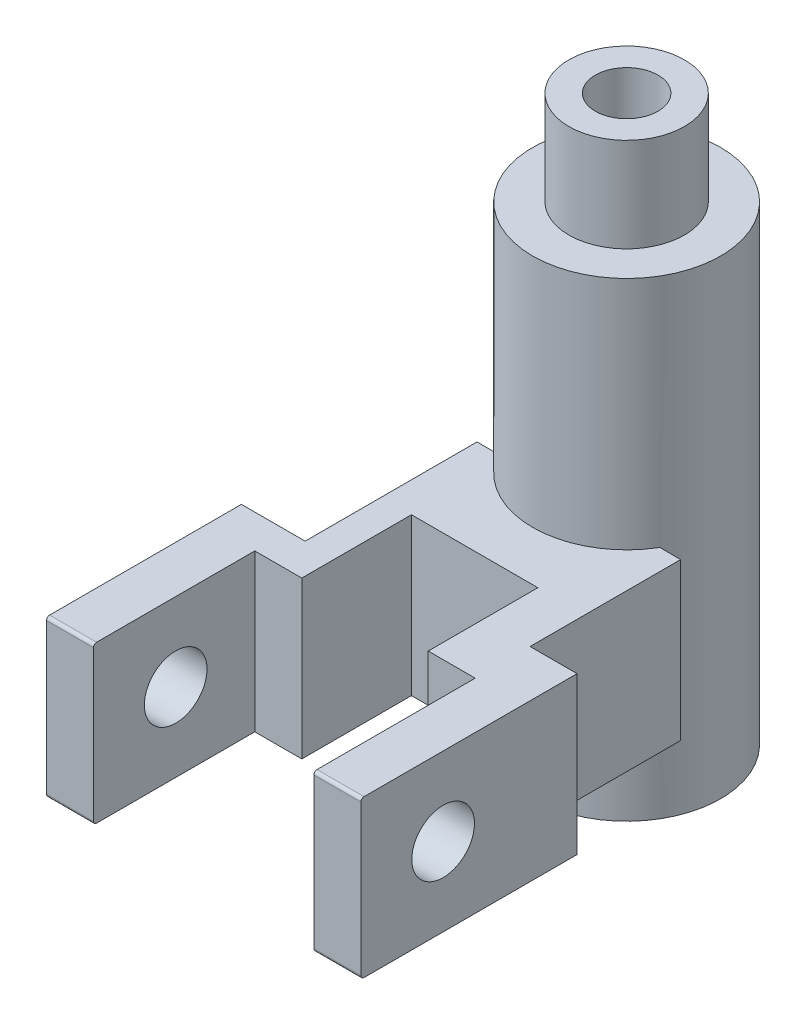
ISO-10303-21;
HEADER;
FILE_DESCRIPTION(('STEP AP214'),'2;1');
FILE_NAME('part.step','',(''),(''),'','','');
FILE_SCHEMA(('AUTOMOTIVE_DESIGN { 1 0 10303 214 1 1 1 1 }'));
ENDSEC;
DATA;
#1=APPLICATION_CONTEXT('core data for automotive mechanical design processes');
#2=APPLICATION_PROTOCOL_DEFINITION('international standard','automotive_design',2000,#1);
#3=PRODUCT_CONTEXT('',#1,'mechanical');
#4=PRODUCT('Part','Part','',(#3));
#5=PRODUCT_RELATED_PRODUCT_CATEGORY('part','',(#4));
#6=PRODUCT_DEFINITION_FORMATION('','',#4);
#7=PRODUCT_DEFINITION_CONTEXT('part definition',#1,'design');
#8=PRODUCT_DEFINITION('design','',#6,#7);
#9=PRODUCT_DEFINITION_SHAPE('','',#8);
#10=(LENGTH_UNIT() NAMED_UNIT(*) SI_UNIT(.MILLI.,.METRE.));
#11=(NAMED_UNIT(*) PLANE_ANGLE_UNIT() SI_UNIT($,.RADIAN.));
#12=(NAMED_UNIT(*) SI_UNIT($,.STERADIAN.) SOLID_ANGLE_UNIT());
#13=UNCERTAINTY_MEASURE_WITH_UNIT(LENGTH_MEASURE(1.E-05),#10,'distance_accuracy_value','');
#14=(GEOMETRIC_REPRESENTATION_CONTEXT(3) GLOBAL_UNCERTAINTY_ASSIGNED_CONTEXT((#13)) GLOBAL_UNIT_ASSIGNED_CONTEXT((#10,
#11,#12)) REPRESENTATION_CONTEXT('',''));
#15=CARTESIAN_POINT('',(0.,0.,0.));
#16=DIRECTION('',(0.,0.,1.));
#17=DIRECTION('',(1.,0.,0.));
#18=AXIS2_PLACEMENT_3D('',#15,#16,#17);
#19=CARTESIAN_POINT('',(22.5141242937853,50.,-46.5536723163842));
#20=DIRECTION('',(0.,0.,1.));
#21=DIRECTION('',(1.,0.,0.));
#22=AXIS2_PLACEMENT_3D('',#19,#20,#21);
#23=PLANE('',#22);
#24=DIRECTION('',(0.,-1.,0.));
#25=VECTOR('',#24,1.);
#26=CARTESIAN_POINT('',(-35.8167045061723,125.,-46.5536723163842));
#27=LINE('',#26,#25);
#28=CARTESIAN_POINT('',(-35.8167045061723,0.,-46.5536723163842));
#29=VERTEX_POINT('',#28);
#30=CARTESIAN_POINT('',(-35.8167045061723,50.,-46.5536723163842));
#31=VERTEX_POINT('',#30);
#32=EDGE_CURVE('E194',#29,#31,#27,.F.);
#33=ORIENTED_EDGE('',*,*,#32,.F.);
#34=DIRECTION('',(-1.,0.,0.));
#35=VECTOR('',#34,1.);
#36=CARTESIAN_POINT('',(22.5141242937853,0.,-46.5536723163842));
#37=LINE('',#36,#35);
#38=CARTESIAN_POINT('',(-42.4858757062147,0.,-46.5536723163842));
#39=VERTEX_POINT('',#38);
#40=EDGE_CURVE('E209',#29,#39,#37,.T.);
#41=ORIENTED_EDGE('',*,*,#40,.T.);
#42=DIRECTION('',(0.,-1.,0.));
#43=VECTOR('',#42,1.);
#44=CARTESIAN_POINT('',(-42.4858757062147,50.,-46.5536723163842));
#45=LINE('',#44,#43);
#46=CARTESIAN_POINT('',(-42.4858757062147,50.,-46.5536723163842));
#47=VERTEX_POINT('',#46);
#48=EDGE_CURVE('E231',#47,#39,#45,.T.);
#49=ORIENTED_EDGE('',*,*,#48,.F.);
#50=DIRECTION('',(-1.,0.,0.));
#51=VECTOR('',#50,1.);
#52=CARTESIAN_POINT('',(22.5141242937853,50.,-46.5536723163842));
#53=LINE('',#52,#51);
#54=EDGE_CURVE('E211',#31,#47,#53,.T.);
#55=ORIENTED_EDGE('',*,*,#54,.F.);
#56=EDGE_LOOP('',(#33,#41,#49,#55));
#57=FACE_BOUND('',#56,.T.);
#58=ADVANCED_FACE('F39',(#57),#23,.F.);
#59=DIRECTION('',(0.,-1.,0.));
#60=VECTOR('',#59,1.);
#61=CARTESIAN_POINT('',(15.8449530937429,125.,-46.5536723163842));
#62=LINE('',#61,#60);
#63=CARTESIAN_POINT('',(15.8449530937429,50.,-46.5536723163842));
#64=VERTEX_POINT('',#63);
#65=CARTESIAN_POINT('',(15.8449530937429,0.,-46.5536723163842));
#66=VERTEX_POINT('',#65);
#67=EDGE_CURVE('E197',#64,#66,#62,.T.);
#68=ORIENTED_EDGE('',*,*,#67,.F.);
#69=CARTESIAN_POINT('',(22.5141242937853,50.,-46.5536723163842));
#70=VERTEX_POINT('',#69);
#71=EDGE_CURVE('E235',#70,#64,#53,.T.);
#72=ORIENTED_EDGE('',*,*,#71,.F.);
#73=DIRECTION('',(0.,-1.,0.));
#74=VECTOR('',#73,1.);
#75=CARTESIAN_POINT('',(22.5141242937853,50.,-46.5536723163842));
#76=LINE('',#75,#74);
#77=CARTESIAN_POINT('',(22.5141242937853,0.,-46.5536723163842));
#78=VERTEX_POINT('',#77);
#79=EDGE_CURVE('E234',#70,#78,#76,.T.);
#80=ORIENTED_EDGE('',*,*,#79,.T.);
#81=EDGE_CURVE('E221',#78,#66,#37,.T.);
#82=ORIENTED_EDGE('',*,*,#81,.T.);
#83=EDGE_LOOP('',(#68,#72,#80,#82));
#84=FACE_BOUND('',#83,.T.);
#85=ADVANCED_FACE('F438',(#84),#23,.F.);
#86=CARTESIAN_POINT('',(-42.4858757062147,50.,-40.6779661016949));
#87=DIRECTION('',(1.,0.,0.));
#88=DIRECTION('',(0.,0.,-1.));
#89=AXIS2_PLACEMENT_3D('',#86,#87,#88);
#90=PLANE('',#89);
#91=DIRECTION('',(0.,0.,1.));
#92=VECTOR('',#91,1.);
#93=CARTESIAN_POINT('',(-42.4858757062147,0.,-40.6779661016949));
#94=LINE('',#93,#92);
#95=CARTESIAN_POINT('',(-42.4858757062147,0.,8.27683615819211));
#96=VERTEX_POINT('',#95);
#97=EDGE_CURVE('E218',#39,#96,#94,.T.);
#98=ORIENTED_EDGE('',*,*,#97,.T.);
#99=DIRECTION('',(0.,-1.,0.));
#100=VECTOR('',#99,1.);
#101=CARTESIAN_POINT('',(-42.4858757062147,50.,8.27683615819211));
#102=LINE('',#101,#100);
#103=CARTESIAN_POINT('',(-42.4858757062147,50.,8.27683615819211));
#104=VERTEX_POINT('',#103);
#105=EDGE_CURVE('E204',#104,#96,#102,.T.);
#106=ORIENTED_EDGE('',*,*,#105,.F.);
#107=DIRECTION('',(0.,0.,1.));
#108=VECTOR('',#107,1.);
#109=CARTESIAN_POINT('',(-42.4858757062147,50.,-46.5536723163842));
#110=LINE('',#109,#108);
#111=EDGE_CURVE('E226',#47,#104,#110,.T.);
#112=ORIENTED_EDGE('',*,*,#111,.F.);
#113=ORIENTED_EDGE('',*,*,#48,.T.);
#114=EDGE_LOOP('',(#98,#106,#112,#113));
#115=FACE_BOUND('',#114,.T.);
#116=ADVANCED_FACE('F467',(#115),#90,.F.);
#117=CARTESIAN_POINT('',(-42.4858757062147,50.,8.27683615819211));
#118=DIRECTION('',(0.,0.,1.));
#119=DIRECTION('',(1.,0.,0.));
#120=AXIS2_PLACEMENT_3D('',#117,#118,#119);
#121=PLANE('',#120);
#122=DIRECTION('',(-1.,0.,0.));
#123=VECTOR('',#122,1.);
#124=CARTESIAN_POINT('',(-42.4858757062147,0.,8.27683615819211));
#125=LINE('',#124,#123);
#126=CARTESIAN_POINT('',(-62.8248587570622,0.,8.27683615819211));
#127=VERTEX_POINT('',#126);
#128=EDGE_CURVE('E392',#96,#127,#125,.T.);
#129=ORIENTED_EDGE('',*,*,#128,.T.);
#130=DIRECTION('',(0.,-1.,0.));
#131=VECTOR('',#130,1.);
#132=CARTESIAN_POINT('',(-62.8248587570622,50.,8.27683615819211));
#133=LINE('',#132,#131);
#134=CARTESIAN_POINT('',(-62.8248587570622,50.,8.27683615819211));
#135=VERTEX_POINT('',#134);
#136=EDGE_CURVE('E287',#135,#127,#133,.T.);
#137=ORIENTED_EDGE('',*,*,#136,.F.);
#138=DIRECTION('',(-1.,0.,0.));
#139=VECTOR('',#138,1.);
#140=CARTESIAN_POINT('',(-42.4858757062147,50.,8.27683615819211));
#141=LINE('',#140,#139);
#142=EDGE_CURVE('E360',#104,#135,#141,.T.);
#143=ORIENTED_EDGE('',*,*,#142,.F.);
#144=ORIENTED_EDGE('',*,*,#105,.T.);
#145=EDGE_LOOP('',(#129,#137,#143,#144));
#146=FACE_BOUND('',#145,.T.);
#147=ADVANCED_FACE('F513',(#146),#121,.F.);
#148=CARTESIAN_POINT('',(-62.8248587570622,50.,39.0112994350283));
#149=DIRECTION('',(1.,0.,0.));
#150=DIRECTION('',(0.,0.,-1.));
#151=AXIS2_PLACEMENT_3D('',#148,#149,#150);
#152=PLANE('',#151);
#153=CARTESIAN_POINT('',(-62.8248587570622,25.,44.2477906118115));
#154=DIRECTION('',(1.,0.,0.));
#155=DIRECTION('',(0.,0.,-1.));
#156=AXIS2_PLACEMENT_3D('',#153,#154,#155);
#157=CIRCLE('',#156,10.);
#158=CARTESIAN_POINT('',(-62.8248587570622,25.,34.2477906118115));
#159=VERTEX_POINT('',#158);
#160=EDGE_CURVE('E585',#159,#159,#157,.T.);
#161=ORIENTED_EDGE('',*,*,#160,.T.);
#162=EDGE_LOOP('',(#161));
#163=FACE_BOUND('',#162,.T.);
#164=DIRECTION('',(0.,0.,1.));
#165=VECTOR('',#164,1.);
#166=CARTESIAN_POINT('',(-62.8248587570622,0.,39.0112994350283));
#167=LINE('',#166,#165);
#168=CARTESIAN_POINT('',(-62.8248587570622,0.,69.4842817885947));
#169=VERTEX_POINT('',#168);
#170=EDGE_CURVE('E396',#127,#169,#167,.T.);
#171=ORIENTED_EDGE('',*,*,#170,.T.);
#172=CARTESIAN_POINT('',(-62.8248587570622,1.,69.4842817885947));
#173=DIRECTION('',(1.,0.,0.));
#174=DIRECTION('',(0.,0.,-1.));
#175=AXIS2_PLACEMENT_3D('',#172,#173,#174);
#176=CIRCLE('',#175,1.);
#177=CARTESIAN_POINT('',(-62.8248587570622,1.,70.4842817885947));
#178=VERTEX_POINT('',#177);
#179=EDGE_CURVE('E316',#169,#178,#176,.F.);
#180=ORIENTED_EDGE('',*,*,#179,.T.);
#181=DIRECTION('',(0.,-1.,0.));
#182=VECTOR('',#181,1.);
#183=CARTESIAN_POINT('',(-62.8248587570622,50.,70.4842817885947));
#184=LINE('',#183,#182);
#185=CARTESIAN_POINT('',(-62.8248587570622,49.,70.4842817885947));
#186=VERTEX_POINT('',#185);
#187=EDGE_CURVE('E283',#186,#178,#184,.T.);
#188=ORIENTED_EDGE('',*,*,#187,.F.);
#189=CARTESIAN_POINT('',(-62.8248587570622,49.,69.4842817885947));
#190=DIRECTION('',(1.,0.,0.));
#191=DIRECTION('',(0.,0.,-1.));
#192=AXIS2_PLACEMENT_3D('',#189,#190,#191);
#193=CIRCLE('',#192,1.);
#194=CARTESIAN_POINT('',(-62.8248587570622,50.,69.4842817885947));
#195=VERTEX_POINT('',#194);
#196=EDGE_CURVE('E313',#186,#195,#193,.F.);
#197=ORIENTED_EDGE('',*,*,#196,.T.);
#198=DIRECTION('',(0.,0.,1.));
#199=VECTOR('',#198,1.);
#200=CARTESIAN_POINT('',(-62.8248587570622,50.,8.27683615819211));
#201=LINE('',#200,#199);
#202=EDGE_CURVE('E346',#135,#195,#201,.T.);
#203=ORIENTED_EDGE('',*,*,#202,.F.);
#204=ORIENTED_EDGE('',*,*,#136,.T.);
#205=EDGE_LOOP('',(#171,#180,#188,#197,#203,#204));
#206=FACE_BOUND('',#205,.T.);
#207=ADVANCED_FACE('F509',(#163,#206),#152,.F.);
#208=CARTESIAN_POINT('',(-62.8248587570622,50.,70.4842817885947));
#209=DIRECTION('',(0.,0.,-1.));
#210=DIRECTION('',(-1.,0.,0.));
#211=AXIS2_PLACEMENT_3D('',#208,#209,#210);
#212=PLANE('',#211);
#213=ORIENTED_EDGE('',*,*,#187,.T.);
#214=DIRECTION('',(1.,0.,0.));
#215=VECTOR('',#214,1.);
#216=CARTESIAN_POINT('',(-47.8248587570622,1.,70.4842817885947));
#217=LINE('',#216,#215);
#218=CARTESIAN_POINT('',(-47.8248587570622,1.,70.4842817885947));
#219=VERTEX_POINT('',#218);
#220=EDGE_CURVE('E297',#178,#219,#217,.T.);
#221=ORIENTED_EDGE('',*,*,#220,.T.);
#222=DIRECTION('',(0.,-1.,0.));
#223=VECTOR('',#222,1.);
#224=CARTESIAN_POINT('',(-47.8248587570622,50.,70.4842817885947));
#225=LINE('',#224,#223);
#226=CARTESIAN_POINT('',(-47.8248587570622,49.,70.4842817885947));
#227=VERTEX_POINT('',#226);
#228=EDGE_CURVE('E279',#227,#219,#225,.T.);
#229=ORIENTED_EDGE('',*,*,#228,.F.);
#230=DIRECTION('',(1.,0.,0.));
#231=VECTOR('',#230,1.);
#232=CARTESIAN_POINT('',(-62.8248587570622,49.,70.4842817885947));
#233=LINE('',#232,#231);
#234=EDGE_CURVE('E294',#227,#186,#233,.F.);
#235=ORIENTED_EDGE('',*,*,#234,.T.);
#236=EDGE_LOOP('',(#213,#221,#229,#235));
#237=FACE_BOUND('',#236,.T.);
#238=ADVANCED_FACE('F505',(#237),#212,.F.);
#239=CARTESIAN_POINT('',(-47.8248587570622,50.,70.4842817885947));
#240=DIRECTION('',(-1.,0.,0.));
#241=DIRECTION('',(0.,0.,1.));
#242=AXIS2_PLACEMENT_3D('',#239,#240,#241);
#243=PLANE('',#242);
#244=CARTESIAN_POINT('',(-47.8248587570622,25.,44.2477906118115));
#245=DIRECTION('',(-1.,0.,0.));
#246=DIRECTION('',(0.,0.,1.));
#247=AXIS2_PLACEMENT_3D('',#244,#245,#246);
#248=CIRCLE('',#247,10.);
#249=CARTESIAN_POINT('',(-47.8248587570622,25.,54.2477906118115));
#250=VERTEX_POINT('',#249);
#251=EDGE_CURVE('E589',#250,#250,#248,.T.);
#252=ORIENTED_EDGE('',*,*,#251,.T.);
#253=EDGE_LOOP('',(#252));
#254=FACE_BOUND('',#253,.T.);
#255=ORIENTED_EDGE('',*,*,#228,.T.);
#256=CARTESIAN_POINT('',(-47.8248587570622,1.,69.4842817885947));
#257=DIRECTION('',(-1.,0.,0.));
#258=DIRECTION('',(0.,0.,1.));
#259=AXIS2_PLACEMENT_3D('',#256,#257,#258);
#260=CIRCLE('',#259,1.);
#261=CARTESIAN_POINT('',(-47.8248587570622,0.,69.4842817885947));
#262=VERTEX_POINT('',#261);
#263=EDGE_CURVE('E304',#219,#262,#260,.F.);
#264=ORIENTED_EDGE('',*,*,#263,.T.);
#265=DIRECTION('',(0.,0.,-1.));
#266=VECTOR('',#265,1.);
#267=CARTESIAN_POINT('',(-47.8248587570622,0.,70.4842817885947));
#268=LINE('',#267,#266);
#269=CARTESIAN_POINT('',(-47.8248587570622,0.,19.0112994350283));
#270=VERTEX_POINT('',#269);
#271=EDGE_CURVE('E400',#262,#270,#268,.T.);
#272=ORIENTED_EDGE('',*,*,#271,.T.);
#273=DIRECTION('',(0.,-1.,0.));
#274=VECTOR('',#273,1.);
#275=CARTESIAN_POINT('',(-47.8248587570622,50.,19.0112994350283));
#276=LINE('',#275,#274);
#277=CARTESIAN_POINT('',(-47.8248587570622,50.,19.0112994350283));
#278=VERTEX_POINT('',#277);
#279=EDGE_CURVE('E275',#278,#270,#276,.T.);
#280=ORIENTED_EDGE('',*,*,#279,.F.);
#281=DIRECTION('',(0.,0.,-1.));
#282=VECTOR('',#281,1.);
#283=CARTESIAN_POINT('',(-47.8248587570622,50.,70.4842817885947));
#284=LINE('',#283,#282);
#285=CARTESIAN_POINT('',(-47.8248587570622,50.,69.4842817885947));
#286=VERTEX_POINT('',#285);
#287=EDGE_CURVE('E343',#286,#278,#284,.T.);
#288=ORIENTED_EDGE('',*,*,#287,.F.);
#289=CARTESIAN_POINT('',(-47.8248587570622,49.,69.4842817885947));
#290=DIRECTION('',(-1.,0.,0.));
#291=DIRECTION('',(0.,0.,1.));
#292=AXIS2_PLACEMENT_3D('',#289,#290,#291);
#293=CIRCLE('',#292,1.);
#294=EDGE_CURVE('E301',#286,#227,#293,.F.);
#295=ORIENTED_EDGE('',*,*,#294,.T.);
#296=EDGE_LOOP('',(#255,#264,#272,#280,#288,#295));
#297=FACE_BOUND('',#296,.T.);
#298=ADVANCED_FACE('F350',(#254,#297),#243,.F.);
#299=CARTESIAN_POINT('',(-47.8248587570622,50.,19.0112994350283));
#300=DIRECTION('',(0.,0.,-1.));
#301=DIRECTION('',(-1.,0.,0.));
#302=AXIS2_PLACEMENT_3D('',#299,#300,#301);
#303=PLANE('',#302);
#304=DIRECTION('',(1.,0.,0.));
#305=VECTOR('',#304,1.);
#306=CARTESIAN_POINT('',(-47.8248587570622,0.,19.0112994350283));
#307=LINE('',#306,#305);
#308=CARTESIAN_POINT('',(-32.8248587570622,0.,19.0112994350283));
#309=VERTEX_POINT('',#308);
#310=EDGE_CURVE('E403',#270,#309,#307,.T.);
#311=ORIENTED_EDGE('',*,*,#310,.T.);
#312=DIRECTION('',(0.,-1.,0.));
#313=VECTOR('',#312,1.);
#314=CARTESIAN_POINT('',(-32.8248587570622,50.,19.0112994350283));
#315=LINE('',#314,#313);
#316=CARTESIAN_POINT('',(-32.8248587570622,50.,19.0112994350283));
#317=VERTEX_POINT('',#316);
#318=EDGE_CURVE('E271',#317,#309,#315,.T.);
#319=ORIENTED_EDGE('',*,*,#318,.F.);
#320=DIRECTION('',(1.,0.,0.));
#321=VECTOR('',#320,1.);
#322=CARTESIAN_POINT('',(-47.8248587570622,50.,19.0112994350283));
#323=LINE('',#322,#321);
#324=EDGE_CURVE('E354',#278,#317,#323,.T.);
#325=ORIENTED_EDGE('',*,*,#324,.F.);
#326=ORIENTED_EDGE('',*,*,#279,.T.);
#327=EDGE_LOOP('',(#311,#319,#325,#326));
#328=FACE_BOUND('',#327,.T.);
#329=ADVANCED_FACE('F498',(#328),#303,.F.);
#330=CARTESIAN_POINT('',(-32.8248587570622,50.,19.0112994350283));
#331=DIRECTION('',(-1.,0.,0.));
#332=DIRECTION('',(0.,0.,1.));
#333=AXIS2_PLACEMENT_3D('',#330,#331,#332);
#334=PLANE('',#333);
#335=DIRECTION('',(0.,0.,-1.));
#336=VECTOR('',#335,1.);
#337=CARTESIAN_POINT('',(-32.8248587570622,0.,19.0112994350283));
#338=LINE('',#337,#336);
#339=CARTESIAN_POINT('',(-32.8248587570622,0.,-15.9887005649717));
#340=VERTEX_POINT('',#339);
#341=EDGE_CURVE('E406',#309,#340,#338,.T.);
#342=ORIENTED_EDGE('',*,*,#341,.T.);
#343=DIRECTION('',(0.,-1.,0.));
#344=VECTOR('',#343,1.);
#345=CARTESIAN_POINT('',(-32.8248587570622,50.,-15.9887005649717));
#346=LINE('',#345,#344);
#347=CARTESIAN_POINT('',(-32.8248587570622,50.,-15.9887005649717));
#348=VERTEX_POINT('',#347);
#349=EDGE_CURVE('E267',#348,#340,#346,.T.);
#350=ORIENTED_EDGE('',*,*,#349,.F.);
#351=DIRECTION('',(0.,0.,-1.));
#352=VECTOR('',#351,1.);
#353=CARTESIAN_POINT('',(-32.8248587570622,50.,19.0112994350283));
#354=LINE('',#353,#352);
#355=EDGE_CURVE('E358',#317,#348,#354,.T.);
#356=ORIENTED_EDGE('',*,*,#355,.F.);
#357=ORIENTED_EDGE('',*,*,#318,.T.);
#358=EDGE_LOOP('',(#342,#350,#356,#357));
#359=FACE_BOUND('',#358,.T.);
#360=ADVANCED_FACE('F494',(#359),#334,.F.);
#361=CARTESIAN_POINT('',(-32.8248587570622,50.,-15.9887005649717));
#362=DIRECTION('',(0.,0.,-1.));
#363=DIRECTION('',(-1.,0.,0.));
#364=AXIS2_PLACEMENT_3D('',#361,#362,#363);
#365=PLANE('',#364);
#366=DIRECTION('',(1.,0.,0.));
#367=VECTOR('',#366,1.);
#368=CARTESIAN_POINT('',(-32.8248587570622,0.,-15.9887005649717));
#369=LINE('',#368,#367);
#370=CARTESIAN_POINT('',(7.51412429378528,0.,-15.9887005649717));
#371=VERTEX_POINT('',#370);
#372=EDGE_CURVE('E409',#340,#371,#369,.T.);
#373=ORIENTED_EDGE('',*,*,#372,.T.);
#374=DIRECTION('',(0.,-1.,0.));
#375=VECTOR('',#374,1.);
#376=CARTESIAN_POINT('',(7.51412429378528,50.,-15.9887005649717));
#377=LINE('',#376,#375);
#378=CARTESIAN_POINT('',(7.51412429378528,50.,-15.9887005649717));
#379=VERTEX_POINT('',#378);
#380=EDGE_CURVE('E263',#379,#371,#377,.T.);
#381=ORIENTED_EDGE('',*,*,#380,.F.);
#382=DIRECTION('',(1.,0.,0.));
#383=VECTOR('',#382,1.);
#384=CARTESIAN_POINT('',(-32.8248587570622,50.,-15.9887005649717));
#385=LINE('',#384,#383);
#386=EDGE_CURVE('E366',#348,#379,#385,.T.);
#387=ORIENTED_EDGE('',*,*,#386,.F.);
#388=ORIENTED_EDGE('',*,*,#349,.T.);
#389=EDGE_LOOP('',(#373,#381,#387,#388));
#390=FACE_BOUND('',#389,.T.);
#391=ADVANCED_FACE('F490',(#390),#365,.F.);
#392=CARTESIAN_POINT('',(7.51412429378528,50.,-15.9887005649717));
#393=DIRECTION('',(1.,0.,0.));
#394=DIRECTION('',(0.,0.,-1.));
#395=AXIS2_PLACEMENT_3D('',#392,#393,#394);
#396=PLANE('',#395);
#397=DIRECTION('',(0.,0.,1.));
#398=VECTOR('',#397,1.);
#399=CARTESIAN_POINT('',(7.51412429378528,0.,-15.9887005649717));
#400=LINE('',#399,#398);
#401=CARTESIAN_POINT('',(7.51412429378529,0.,19.0112994350283));
#402=VERTEX_POINT('',#401);
#403=EDGE_CURVE('E412',#371,#402,#400,.T.);
#404=ORIENTED_EDGE('',*,*,#403,.T.);
#405=DIRECTION('',(0.,-1.,0.));
#406=VECTOR('',#405,1.);
#407=CARTESIAN_POINT('',(7.51412429378529,50.,19.0112994350283));
#408=LINE('',#407,#406);
#409=CARTESIAN_POINT('',(7.51412429378529,50.,19.0112994350283));
#410=VERTEX_POINT('',#409);
#411=EDGE_CURVE('E259',#410,#402,#408,.T.);
#412=ORIENTED_EDGE('',*,*,#411,.F.);
#413=DIRECTION('',(0.,0.,1.));
#414=VECTOR('',#413,1.);
#415=CARTESIAN_POINT('',(7.51412429378528,50.,-15.9887005649717));
#416=LINE('',#415,#414);
#417=EDGE_CURVE('E369',#379,#410,#416,.T.);
#418=ORIENTED_EDGE('',*,*,#417,.F.);
#419=ORIENTED_EDGE('',*,*,#380,.T.);
#420=EDGE_LOOP('',(#404,#412,#418,#419));
#421=FACE_BOUND('',#420,.T.);
#422=ADVANCED_FACE('F486',(#421),#396,.F.);
#423=CARTESIAN_POINT('',(7.51412429378529,50.,19.0112994350283));
#424=DIRECTION('',(0.,0.,-1.));
#425=DIRECTION('',(-1.,0.,0.));
#426=AXIS2_PLACEMENT_3D('',#423,#424,#425);
#427=PLANE('',#426);
#428=DIRECTION('',(1.,0.,0.));
#429=VECTOR('',#428,1.);
#430=CARTESIAN_POINT('',(7.51412429378529,0.,19.0112994350283));
#431=LINE('',#430,#429);
#432=CARTESIAN_POINT('',(22.5141242937853,0.,19.0112994350283));
#433=VERTEX_POINT('',#432);
#434=EDGE_CURVE('E415',#402,#433,#431,.T.);
#435=ORIENTED_EDGE('',*,*,#434,.T.);
#436=DIRECTION('',(0.,-1.,0.));
#437=VECTOR('',#436,1.);
#438=CARTESIAN_POINT('',(22.5141242937853,50.,19.0112994350283));
#439=LINE('',#438,#437);
#440=CARTESIAN_POINT('',(22.5141242937853,50.,19.0112994350283));
#441=VERTEX_POINT('',#440);
#442=EDGE_CURVE('E255',#441,#433,#439,.T.);
#443=ORIENTED_EDGE('',*,*,#442,.F.);
#444=DIRECTION('',(1.,0.,0.));
#445=VECTOR('',#444,1.);
#446=CARTESIAN_POINT('',(7.51412429378529,50.,19.0112994350283));
#447=LINE('',#446,#445);
#448=EDGE_CURVE('E372',#410,#441,#447,.T.);
#449=ORIENTED_EDGE('',*,*,#448,.F.);
#450=ORIENTED_EDGE('',*,*,#411,.T.);
#451=EDGE_LOOP('',(#435,#443,#449,#450));
#452=FACE_BOUND('',#451,.T.);
#453=ADVANCED_FACE('F482',(#452),#427,.F.);
#454=CARTESIAN_POINT('',(22.5141242937853,50.,70.4842817885947));
#455=DIRECTION('',(1.,0.,0.));
#456=DIRECTION('',(0.,0.,-1.));
#457=AXIS2_PLACEMENT_3D('',#454,#455,#456);
#458=PLANE('',#457);
#459=CARTESIAN_POINT('',(22.5141242937853,25.,44.2477906118115));
#460=DIRECTION('',(1.,0.,0.));
#461=DIRECTION('',(0.,0.,-1.));
#462=AXIS2_PLACEMENT_3D('',#459,#460,#461);
#463=CIRCLE('',#462,10.);
#464=CARTESIAN_POINT('',(22.5141242937853,25.,34.2477906118115));
#465=VERTEX_POINT('',#464);
#466=EDGE_CURVE('E593',#465,#465,#463,.T.);
#467=ORIENTED_EDGE('',*,*,#466,.T.);
#468=EDGE_LOOP('',(#467));
#469=FACE_BOUND('',#468,.T.);
#470=DIRECTION('',(0.,0.,1.));
#471=VECTOR('',#470,1.);
#472=CARTESIAN_POINT('',(22.5141242937853,0.,70.4842817885947));
#473=LINE('',#472,#471);
#474=CARTESIAN_POINT('',(22.5141242937853,0.,69.4842817885947));
#475=VERTEX_POINT('',#474);
#476=EDGE_CURVE('E418',#433,#475,#473,.T.);
#477=ORIENTED_EDGE('',*,*,#476,.T.);
#478=CARTESIAN_POINT('',(22.5141242937853,1.,69.4842817885947));
#479=DIRECTION('',(1.,0.,0.));
#480=DIRECTION('',(0.,0.,-1.));
#481=AXIS2_PLACEMENT_3D('',#478,#479,#480);
#482=CIRCLE('',#481,1.);
#483=CARTESIAN_POINT('',(22.5141242937853,1.,70.4842817885947));
#484=VERTEX_POINT('',#483);
#485=EDGE_CURVE('E333',#475,#484,#482,.F.);
#486=ORIENTED_EDGE('',*,*,#485,.T.);
#487=DIRECTION('',(0.,-1.,0.));
#488=VECTOR('',#487,1.);
#489=CARTESIAN_POINT('',(22.5141242937853,50.,70.4842817885947));
#490=LINE('',#489,#488);
#491=CARTESIAN_POINT('',(22.5141242937853,49.,70.4842817885947));
#492=VERTEX_POINT('',#491);
#493=EDGE_CURVE('E251',#492,#484,#490,.T.);
#494=ORIENTED_EDGE('',*,*,#493,.F.);
#495=CARTESIAN_POINT('',(22.5141242937853,49.,69.4842817885947));
#496=DIRECTION('',(1.,0.,0.));
#497=DIRECTION('',(0.,0.,-1.));
#498=AXIS2_PLACEMENT_3D('',#495,#496,#497);
#499=CIRCLE('',#498,1.);
#500=CARTESIAN_POINT('',(22.5141242937853,50.,69.4842817885947));
#501=VERTEX_POINT('',#500);
#502=EDGE_CURVE('E56',#492,#501,#499,.F.);
#503=ORIENTED_EDGE('',*,*,#502,.T.);
#504=DIRECTION('',(0.,0.,1.));
#505=VECTOR('',#504,1.);
#506=CARTESIAN_POINT('',(22.5141242937853,50.,70.4842817885947));
#507=LINE('',#506,#505);
#508=EDGE_CURVE('E375',#441,#501,#507,.T.);
#509=ORIENTED_EDGE('',*,*,#508,.F.);
#510=ORIENTED_EDGE('',*,*,#442,.T.);
#511=EDGE_LOOP('',(#477,#486,#494,#503,#509,#510));
#512=FACE_BOUND('',#511,.T.);
#513=ADVANCED_FACE('F449',(#469,#512),#458,.F.);
#514=CARTESIAN_POINT('',(37.5141242937853,50.,70.4842817885947));
#515=DIRECTION('',(0.,0.,-1.));
#516=DIRECTION('',(-1.,0.,0.));
#517=AXIS2_PLACEMENT_3D('',#514,#515,#516);
#518=PLANE('',#517);
#519=ORIENTED_EDGE('',*,*,#493,.T.);
#520=DIRECTION('',(1.,0.,0.));
#521=VECTOR('',#520,1.);
#522=CARTESIAN_POINT('',(37.5141242937853,1.,70.4842817885947));
#523=LINE('',#522,#521);
#524=CARTESIAN_POINT('',(37.5141242937853,1.,70.4842817885947));
#525=VERTEX_POINT('',#524);
#526=EDGE_CURVE('E322',#484,#525,#523,.T.);
#527=ORIENTED_EDGE('',*,*,#526,.T.);
#528=DIRECTION('',(0.,-1.,0.));
#529=VECTOR('',#528,1.);
#530=CARTESIAN_POINT('',(37.5141242937853,50.,70.4842817885947));
#531=LINE('',#530,#529);
#532=CARTESIAN_POINT('',(37.5141242937853,49.,70.4842817885947));
#533=VERTEX_POINT('',#532);
#534=EDGE_CURVE('E247',#533,#525,#531,.T.);
#535=ORIENTED_EDGE('',*,*,#534,.F.);
#536=DIRECTION('',(1.,0.,0.));
#537=VECTOR('',#536,1.);
#538=CARTESIAN_POINT('',(37.5141242937853,49.,70.4842817885947));
#539=LINE('',#538,#537);
#540=EDGE_CURVE('E319',#533,#492,#539,.F.);
#541=ORIENTED_EDGE('',*,*,#540,.T.);
#542=EDGE_LOOP('',(#519,#527,#535,#541));
#543=FACE_BOUND('',#542,.T.);
#544=ADVANCED_FACE('F451',(#543),#518,.F.);
#545=CARTESIAN_POINT('',(37.5141242937853,50.,39.0112994350283));
#546=DIRECTION('',(-1.,0.,0.));
#547=DIRECTION('',(0.,0.,1.));
#548=AXIS2_PLACEMENT_3D('',#545,#546,#547);
#549=PLANE('',#548);
#550=CARTESIAN_POINT('',(37.5141242937853,25.,44.2477906118115));
#551=DIRECTION('',(-1.,0.,0.));
#552=DIRECTION('',(0.,0.,1.));
#553=AXIS2_PLACEMENT_3D('',#550,#551,#552);
#554=CIRCLE('',#553,10.);
#555=CARTESIAN_POINT('',(37.5141242937853,25.,54.2477906118115));
#556=VERTEX_POINT('',#555);
#557=EDGE_CURVE('E43',#556,#556,#554,.T.);
#558=ORIENTED_EDGE('',*,*,#557,.T.);
#559=EDGE_LOOP('',(#558));
#560=FACE_BOUND('',#559,.T.);
#561=ORIENTED_EDGE('',*,*,#534,.T.);
#562=CARTESIAN_POINT('',(37.5141242937853,1.,69.4842817885947));
#563=DIRECTION('',(-1.,0.,0.));
#564=DIRECTION('',(0.,0.,1.));
#565=AXIS2_PLACEMENT_3D('',#562,#563,#564);
#566=CIRCLE('',#565,1.);
#567=CARTESIAN_POINT('',(37.5141242937853,0.,69.4842817885947));
#568=VERTEX_POINT('',#567);
#569=EDGE_CURVE('E328',#525,#568,#566,.F.);
#570=ORIENTED_EDGE('',*,*,#569,.T.);
#571=DIRECTION('',(0.,0.,-1.));
#572=VECTOR('',#571,1.);
#573=CARTESIAN_POINT('',(37.5141242937853,0.,39.0112994350283));
#574=LINE('',#573,#572);
#575=CARTESIAN_POINT('',(37.5141242937853,0.,1.5112994350283));
#576=VERTEX_POINT('',#575);
#577=EDGE_CURVE('E422',#568,#576,#574,.T.);
#578=ORIENTED_EDGE('',*,*,#577,.T.);
#579=DIRECTION('',(0.,-1.,0.));
#580=VECTOR('',#579,1.);
#581=CARTESIAN_POINT('',(37.5141242937853,50.,1.5112994350283));
#582=LINE('',#581,#580);
#583=CARTESIAN_POINT('',(37.5141242937853,50.,1.5112994350283));
#584=VERTEX_POINT('',#583);
#585=EDGE_CURVE('E243',#584,#576,#582,.T.);
#586=ORIENTED_EDGE('',*,*,#585,.F.);
#587=DIRECTION('',(0.,0.,-1.));
#588=VECTOR('',#587,1.);
#589=CARTESIAN_POINT('',(37.5141242937853,50.,39.0112994350283));
#590=LINE('',#589,#588);
#591=CARTESIAN_POINT('',(37.5141242937853,50.,69.4842817885947));
#592=VERTEX_POINT('',#591);
#593=EDGE_CURVE('E378',#592,#584,#590,.T.);
#594=ORIENTED_EDGE('',*,*,#593,.F.);
#595=CARTESIAN_POINT('',(37.5141242937853,49.,69.4842817885947));
#596=DIRECTION('',(-1.,0.,0.));
#597=DIRECTION('',(0.,0.,1.));
#598=AXIS2_PLACEMENT_3D('',#595,#596,#597);
#599=CIRCLE('',#598,1.);
#600=EDGE_CURVE('E64',#592,#533,#599,.F.);
#601=ORIENTED_EDGE('',*,*,#600,.T.);
#602=EDGE_LOOP('',(#561,#570,#578,#586,#594,#601));
#603=FACE_BOUND('',#602,.T.);
#604=ADVANCED_FACE('F442',(#560,#603),#549,.F.);
#605=CARTESIAN_POINT('',(37.5141242937853,50.,1.5112994350283));
#606=DIRECTION('',(0.,0.,1.));
#607=DIRECTION('',(1.,0.,0.));
#608=AXIS2_PLACEMENT_3D('',#605,#606,#607);
#609=PLANE('',#608);
#610=DIRECTION('',(-1.,0.,0.));
#611=VECTOR('',#610,1.);
#612=CARTESIAN_POINT('',(37.5141242937853,0.,1.5112994350283));
#613=LINE('',#612,#611);
#614=CARTESIAN_POINT('',(22.5141242937853,0.,1.5112994350283));
#615=VERTEX_POINT('',#614);
#616=EDGE_CURVE('E227',#576,#615,#613,.T.);
#617=ORIENTED_EDGE('',*,*,#616,.T.);
#618=DIRECTION('',(0.,-1.,0.));
#619=VECTOR('',#618,1.);
#620=CARTESIAN_POINT('',(22.5141242937853,50.,1.5112994350283));
#621=LINE('',#620,#619);
#622=CARTESIAN_POINT('',(22.5141242937853,50.,1.5112994350283));
#623=VERTEX_POINT('',#622);
#624=EDGE_CURVE('E239',#623,#615,#621,.T.);
#625=ORIENTED_EDGE('',*,*,#624,.F.);
#626=DIRECTION('',(-1.,0.,0.));
#627=VECTOR('',#626,1.);
#628=CARTESIAN_POINT('',(37.5141242937853,50.,1.5112994350283));
#629=LINE('',#628,#627);
#630=EDGE_CURVE('E381',#584,#623,#629,.T.);
#631=ORIENTED_EDGE('',*,*,#630,.F.);
#632=ORIENTED_EDGE('',*,*,#585,.T.);
#633=EDGE_LOOP('',(#617,#625,#631,#632));
#634=FACE_BOUND('',#633,.T.);
#635=ADVANCED_FACE('F428',(#634),#609,.F.);
#636=CARTESIAN_POINT('',(22.5141242937853,50.,1.5112994350283));
#637=DIRECTION('',(-1.,0.,0.));
#638=DIRECTION('',(0.,0.,1.));
#639=AXIS2_PLACEMENT_3D('',#636,#637,#638);
#640=PLANE('',#639);
#641=DIRECTION('',(0.,0.,-1.));
#642=VECTOR('',#641,1.);
#643=CARTESIAN_POINT('',(22.5141242937853,0.,1.5112994350283));
#644=LINE('',#643,#642);
#645=EDGE_CURVE('E222',#615,#78,#644,.T.);
#646=ORIENTED_EDGE('',*,*,#645,.T.);
#647=ORIENTED_EDGE('',*,*,#79,.F.);
#648=DIRECTION('',(0.,0.,-1.));
#649=VECTOR('',#648,1.);
#650=CARTESIAN_POINT('',(22.5141242937853,50.,1.5112994350283));
#651=LINE('',#650,#649);
#652=EDGE_CURVE('E384',#623,#70,#651,.T.);
#653=ORIENTED_EDGE('',*,*,#652,.F.);
#654=ORIENTED_EDGE('',*,*,#624,.T.);
#655=EDGE_LOOP('',(#646,#647,#653,#654));
#656=FACE_BOUND('',#655,.T.);
#657=ADVANCED_FACE('F435',(#656),#640,.F.);
#658=CARTESIAN_POINT('',(0.,50.,0.));
#659=DIRECTION('',(0.,-1.,0.));
#660=DIRECTION('',(0.,0.,-1.));
#661=AXIS2_PLACEMENT_3D('',#658,#659,#660);
#662=PLANE('',#661);
#663=ORIENTED_EDGE('',*,*,#508,.T.);
#664=DIRECTION('',(1.,0.,0.));
#665=VECTOR('',#664,1.);
#666=CARTESIAN_POINT('',(0.,50.,69.4842817885947));
#667=LINE('',#666,#665);
#668=EDGE_CURVE('E11',#501,#592,#667,.T.);
#669=ORIENTED_EDGE('',*,*,#668,.T.);
#670=ORIENTED_EDGE('',*,*,#593,.T.);
#671=ORIENTED_EDGE('',*,*,#630,.T.);
#672=ORIENTED_EDGE('',*,*,#652,.T.);
#673=ORIENTED_EDGE('',*,*,#71,.T.);
#674=CARTESIAN_POINT('',(-9.98587570621471,50.,-61.8104178247579));
#675=DIRECTION('',(0.,-1.,0.));
#676=DIRECTION('',(0.,0.,-1.));
#677=AXIS2_PLACEMENT_3D('',#674,#675,#676);
#678=CIRCLE('',#677,30.);
#679=EDGE_CURVE('E213',#31,#64,#678,.F.);
#680=ORIENTED_EDGE('',*,*,#679,.F.);
#681=ORIENTED_EDGE('',*,*,#54,.T.);
#682=ORIENTED_EDGE('',*,*,#111,.T.);
#683=ORIENTED_EDGE('',*,*,#142,.T.);
#684=ORIENTED_EDGE('',*,*,#202,.T.);
#685=DIRECTION('',(1.,0.,0.));
#686=VECTOR('',#685,1.);
#687=CARTESIAN_POINT('',(0.,50.,69.4842817885947));
#688=LINE('',#687,#686);
#689=EDGE_CURVE('E49',#195,#286,#688,.T.);
#690=ORIENTED_EDGE('',*,*,#689,.T.);
#691=ORIENTED_EDGE('',*,*,#287,.T.);
#692=ORIENTED_EDGE('',*,*,#324,.T.);
#693=ORIENTED_EDGE('',*,*,#355,.T.);
#694=ORIENTED_EDGE('',*,*,#386,.T.);
#695=ORIENTED_EDGE('',*,*,#417,.T.);
#696=ORIENTED_EDGE('',*,*,#448,.T.);
#697=EDGE_LOOP('',(#663,#669,#670,#671,#672,#673,#680,#681,#682,#683,#684,#690,#691,#692,#693,
#694,#695,#696));
#698=FACE_BOUND('',#697,.T.);
#699=ADVANCED_FACE('F342',(#698),#662,.F.);
#700=CARTESIAN_POINT('',(0.,0.,0.));
#701=DIRECTION('',(0.,-1.,0.));
#702=DIRECTION('',(0.,0.,-1.));
#703=AXIS2_PLACEMENT_3D('',#700,#701,#702);
#704=PLANE('',#703);
#705=ORIENTED_EDGE('',*,*,#271,.F.);
#706=DIRECTION('',(1.,0.,0.));
#707=VECTOR('',#706,1.);
#708=CARTESIAN_POINT('',(-62.8248587570622,0.,69.4842817885947));
#709=LINE('',#708,#707);
#710=EDGE_CURVE('E310',#262,#169,#709,.F.);
#711=ORIENTED_EDGE('',*,*,#710,.T.);
#712=ORIENTED_EDGE('',*,*,#170,.F.);
#713=ORIENTED_EDGE('',*,*,#128,.F.);
#714=ORIENTED_EDGE('',*,*,#97,.F.);
#715=ORIENTED_EDGE('',*,*,#40,.F.);
#716=CARTESIAN_POINT('',(-9.98587570621471,0.,-61.8104178247579));
#717=DIRECTION('',(0.,-1.,0.));
#718=DIRECTION('',(0.,0.,-1.));
#719=AXIS2_PLACEMENT_3D('',#716,#717,#718);
#720=CIRCLE('',#719,30.);
#721=EDGE_CURVE('E191',#29,#66,#720,.F.);
#722=ORIENTED_EDGE('',*,*,#721,.T.);
#723=ORIENTED_EDGE('',*,*,#81,.F.);
#724=ORIENTED_EDGE('',*,*,#645,.F.);
#725=ORIENTED_EDGE('',*,*,#616,.F.);
#726=ORIENTED_EDGE('',*,*,#577,.F.);
#727=DIRECTION('',(1.,0.,0.));
#728=VECTOR('',#727,1.);
#729=CARTESIAN_POINT('',(22.5141242937853,0.,69.4842817885947));
#730=LINE('',#729,#728);
#731=EDGE_CURVE('E307',#568,#475,#730,.F.);
#732=ORIENTED_EDGE('',*,*,#731,.T.);
#733=ORIENTED_EDGE('',*,*,#476,.F.);
#734=ORIENTED_EDGE('',*,*,#434,.F.);
#735=ORIENTED_EDGE('',*,*,#403,.F.);
#736=ORIENTED_EDGE('',*,*,#372,.F.);
#737=ORIENTED_EDGE('',*,*,#341,.F.);
#738=ORIENTED_EDGE('',*,*,#310,.F.);
#739=EDGE_LOOP('',(#705,#711,#712,#713,#714,#715,#722,#723,#724,#725,#726,#732,#733,#734,#735,
#736,#737,#738));
#740=FACE_BOUND('',#739,.T.);
#741=ADVANCED_FACE('F216',(#740),#704,.T.);
#742=CARTESIAN_POINT('',(-9.98587570621471,125.,-61.8104178247579));
#743=DIRECTION('',(0.,-1.,0.));
#744=DIRECTION('',(0.,0.,-1.));
#745=AXIS2_PLACEMENT_3D('',#742,#743,#744);
#746=CYLINDRICAL_SURFACE('',#745,30.);
#747=CARTESIAN_POINT('',(-9.98587570621471,125.,-61.8104178247579));
#748=DIRECTION('',(0.,1.,0.));
#749=DIRECTION('',(0.,0.,1.));
#750=AXIS2_PLACEMENT_3D('',#747,#748,#749);
#751=CIRCLE('',#750,30.);
#752=CARTESIAN_POINT('',(-9.98587570621471,125.,-31.8104178247579));
#753=VERTEX_POINT('',#752);
#754=EDGE_CURVE('E562',#753,#753,#751,.T.);
#755=ORIENTED_EDGE('',*,*,#754,.F.);
#756=EDGE_LOOP('',(#755));
#757=FACE_BOUND('',#756,.T.);
#758=CARTESIAN_POINT('',(-9.98587570621471,-25.,-61.8104178247579));
#759=DIRECTION('',(0.,1.,0.));
#760=DIRECTION('',(0.,0.,1.));
#761=AXIS2_PLACEMENT_3D('',#758,#759,#760);
#762=CIRCLE('',#761,30.);
#763=CARTESIAN_POINT('',(-9.98587570621471,-25.,-31.8104178247579));
#764=VERTEX_POINT('',#763);
#765=EDGE_CURVE('E563',#764,#764,#762,.T.);
#766=ORIENTED_EDGE('',*,*,#765,.T.);
#767=EDGE_LOOP('',(#766));
#768=FACE_BOUND('',#767,.T.);
#769=ORIENTED_EDGE('',*,*,#32,.T.);
#770=ORIENTED_EDGE('',*,*,#679,.T.);
#771=ORIENTED_EDGE('',*,*,#67,.T.);
#772=ORIENTED_EDGE('',*,*,#721,.F.);
#773=EDGE_LOOP('',(#769,#770,#771,#772));
#774=FACE_BOUND('',#773,.T.);
#775=ADVANCED_FACE('F193',(#757,#768,#774),#746,.T.);
#776=CARTESIAN_POINT('',(-9.98587570621471,125.,-61.8104178247579));
#777=DIRECTION('',(0.,1.,0.));
#778=DIRECTION('',(0.,0.,1.));
#779=AXIS2_PLACEMENT_3D('',#776,#777,#778);
#780=PLANE('',#779);
#781=CARTESIAN_POINT('',(-9.98587570621471,125.,-61.8104178247579));
#782=DIRECTION('',(0.,1.,0.));
#783=DIRECTION('',(0.,0.,1.));
#784=AXIS2_PLACEMENT_3D('',#781,#782,#783);
#785=CIRCLE('',#784,18.4359788653074);
#786=CARTESIAN_POINT('',(-9.98587570621471,125.,-43.3744389594505));
#787=VERTEX_POINT('',#786);
#788=EDGE_CURVE('E203',#787,#787,#785,.T.);
#789=ORIENTED_EDGE('',*,*,#788,.F.);
#790=EDGE_LOOP('',(#789));
#791=FACE_BOUND('',#790,.T.);
#792=ORIENTED_EDGE('',*,*,#754,.T.);
#793=EDGE_LOOP('',(#792));
#794=FACE_BOUND('',#793,.T.);
#795=ADVANCED_FACE('F618',(#791,#794),#780,.T.);
#796=CARTESIAN_POINT('',(-9.98587570621471,-25.,-61.8104178247579));
#797=DIRECTION('',(0.,1.,0.));
#798=DIRECTION('',(0.,0.,1.));
#799=AXIS2_PLACEMENT_3D('',#796,#797,#798);
#800=PLANE('',#799);
#801=CARTESIAN_POINT('',(-9.98587570621471,-25.,-61.8104178247579));
#802=DIRECTION('',(0.,1.,0.));
#803=DIRECTION('',(0.,0.,1.));
#804=AXIS2_PLACEMENT_3D('',#801,#802,#803);
#805=CIRCLE('',#804,10.);
#806=CARTESIAN_POINT('',(-9.98587570621471,-25.,-51.8104178247579));
#807=VERTEX_POINT('',#806);
#808=EDGE_CURVE('E577',#807,#807,#805,.T.);
#809=ORIENTED_EDGE('',*,*,#808,.T.);
#810=EDGE_LOOP('',(#809));
#811=FACE_BOUND('',#810,.T.);
#812=ORIENTED_EDGE('',*,*,#765,.F.);
#813=EDGE_LOOP('',(#812));
#814=FACE_BOUND('',#813,.T.);
#815=ADVANCED_FACE('F616',(#811,#814),#800,.F.);
#816=CARTESIAN_POINT('',(-9.98587570621471,155.,-61.8104178247579));
#817=DIRECTION('',(0.,-1.,0.));
#818=DIRECTION('',(0.,0.,-1.));
#819=AXIS2_PLACEMENT_3D('',#816,#817,#818);
#820=CYLINDRICAL_SURFACE('',#819,18.4359788653074);
#821=CARTESIAN_POINT('',(-9.98587570621471,155.,-61.8104178247579));
#822=DIRECTION('',(0.,1.,0.));
#823=DIRECTION('',(0.,0.,1.));
#824=AXIS2_PLACEMENT_3D('',#821,#822,#823);
#825=CIRCLE('',#824,18.4359788653074);
#826=CARTESIAN_POINT('',(-9.98587570621471,155.,-43.3744389594505));
#827=VERTEX_POINT('',#826);
#828=EDGE_CURVE('E567',#827,#827,#825,.T.);
#829=ORIENTED_EDGE('',*,*,#828,.F.);
#830=EDGE_LOOP('',(#829));
#831=FACE_BOUND('',#830,.T.);
#832=ORIENTED_EDGE('',*,*,#788,.T.);
#833=EDGE_LOOP('',(#832));
#834=FACE_BOUND('',#833,.T.);
#835=ADVANCED_FACE('F612',(#831,#834),#820,.T.);
#836=CARTESIAN_POINT('',(-9.98587570621471,155.,-61.8104178247579));
#837=DIRECTION('',(0.,1.,0.));
#838=DIRECTION('',(0.,0.,1.));
#839=AXIS2_PLACEMENT_3D('',#836,#837,#838);
#840=PLANE('',#839);
#841=CARTESIAN_POINT('',(-9.98587570621471,155.,-61.8104178247579));
#842=DIRECTION('',(0.,1.,0.));
#843=DIRECTION('',(0.,0.,1.));
#844=AXIS2_PLACEMENT_3D('',#841,#842,#843);
#845=CIRCLE('',#844,10.);
#846=CARTESIAN_POINT('',(-9.98587570621471,155.,-51.8104178247579));
#847=VERTEX_POINT('',#846);
#848=EDGE_CURVE('E581',#847,#847,#845,.T.);
#849=ORIENTED_EDGE('',*,*,#848,.F.);
#850=EDGE_LOOP('',(#849));
#851=FACE_BOUND('',#850,.T.);
#852=ORIENTED_EDGE('',*,*,#828,.T.);
#853=EDGE_LOOP('',(#852));
#854=FACE_BOUND('',#853,.T.);
#855=ADVANCED_FACE('F527',(#851,#854),#840,.T.);
#856=CARTESIAN_POINT('',(-9.98587570621471,-65.0000000000001,-61.8104178247579));
#857=DIRECTION('',(0.,1.,0.));
#858=DIRECTION('',(0.,0.,1.));
#859=AXIS2_PLACEMENT_3D('',#856,#857,#858);
#860=CYLINDRICAL_SURFACE('',#859,10.);
#861=ORIENTED_EDGE('',*,*,#848,.T.);
#862=EDGE_LOOP('',(#861));
#863=FACE_BOUND('',#862,.T.);
#864=ORIENTED_EDGE('',*,*,#808,.F.);
#865=EDGE_LOOP('',(#864));
#866=FACE_BOUND('',#865,.T.);
#867=ADVANCED_FACE('F522',(#863,#866),#860,.F.);
#868=CARTESIAN_POINT('',(-62.8248587570622,1.,69.4842817885947));
#869=DIRECTION('',(-1.,0.,0.));
#870=DIRECTION('',(0.,0.,1.));
#871=AXIS2_PLACEMENT_3D('',#868,#869,#870);
#872=CYLINDRICAL_SURFACE('',#871,1.);
#873=ORIENTED_EDGE('',*,*,#179,.F.);
#874=ORIENTED_EDGE('',*,*,#710,.F.);
#875=ORIENTED_EDGE('',*,*,#263,.F.);
#876=ORIENTED_EDGE('',*,*,#220,.F.);
#877=EDGE_LOOP('',(#873,#874,#875,#876));
#878=FACE_BOUND('',#877,.T.);
#879=ADVANCED_FACE('F460',(#878),#872,.T.);
#880=CARTESIAN_POINT('',(37.5141242937853,1.,69.4842817885947));
#881=DIRECTION('',(-1.,0.,0.));
#882=DIRECTION('',(0.,0.,1.));
#883=AXIS2_PLACEMENT_3D('',#880,#881,#882);
#884=CYLINDRICAL_SURFACE('',#883,1.);
#885=ORIENTED_EDGE('',*,*,#485,.F.);
#886=ORIENTED_EDGE('',*,*,#731,.F.);
#887=ORIENTED_EDGE('',*,*,#569,.F.);
#888=ORIENTED_EDGE('',*,*,#526,.F.);
#889=EDGE_LOOP('',(#885,#886,#887,#888));
#890=FACE_BOUND('',#889,.T.);
#891=ADVANCED_FACE('F447',(#890),#884,.T.);
#892=CARTESIAN_POINT('',(0.,49.,69.4842817885947));
#893=DIRECTION('',(1.,0.,0.));
#894=DIRECTION('',(0.,0.,-1.));
#895=AXIS2_PLACEMENT_3D('',#892,#893,#894);
#896=CYLINDRICAL_SURFACE('',#895,1.);
#897=ORIENTED_EDGE('',*,*,#502,.F.);
#898=ORIENTED_EDGE('',*,*,#540,.F.);
#899=ORIENTED_EDGE('',*,*,#600,.F.);
#900=ORIENTED_EDGE('',*,*,#668,.F.);
#901=EDGE_LOOP('',(#897,#898,#899,#900));
#902=FACE_BOUND('',#901,.T.);
#903=ADVANCED_FACE('F453',(#902),#896,.T.);
#904=CARTESIAN_POINT('',(0.,49.,69.4842817885947));
#905=DIRECTION('',(1.,0.,0.));
#906=DIRECTION('',(0.,0.,-1.));
#907=AXIS2_PLACEMENT_3D('',#904,#905,#906);
#908=CYLINDRICAL_SURFACE('',#907,1.);
#909=ORIENTED_EDGE('',*,*,#196,.F.);
#910=ORIENTED_EDGE('',*,*,#234,.F.);
#911=ORIENTED_EDGE('',*,*,#294,.F.);
#912=ORIENTED_EDGE('',*,*,#689,.F.);
#913=EDGE_LOOP('',(#909,#910,#911,#912));
#914=FACE_BOUND('',#913,.T.);
#915=ADVANCED_FACE('F41',(#914),#908,.T.);
#916=CARTESIAN_POINT('',(-157.824858757062,25.,44.2477906118115));
#917=DIRECTION('',(1.,0.,0.));
#918=DIRECTION('',(0.,0.,-1.));
#919=AXIS2_PLACEMENT_3D('',#916,#917,#918);
#920=CYLINDRICAL_SURFACE('',#919,10.);
#921=ORIENTED_EDGE('',*,*,#557,.F.);
#922=EDGE_LOOP('',(#921));
#923=FACE_BOUND('',#922,.T.);
#924=ORIENTED_EDGE('',*,*,#466,.F.);
#925=EDGE_LOOP('',(#924));
#926=FACE_BOUND('',#925,.T.);
#927=ADVANCED_FACE('F459',(#923,#926),#920,.F.);
#928=ORIENTED_EDGE('',*,*,#251,.F.);
#929=EDGE_LOOP('',(#928));
#930=FACE_BOUND('',#929,.T.);
#931=ORIENTED_EDGE('',*,*,#160,.F.);
#932=EDGE_LOOP('',(#931));
#933=FACE_BOUND('',#932,.T.);
#934=ADVANCED_FACE('F603',(#930,#933),#920,.F.);
#935=CLOSED_SHELL('',(#58,#85,#116,#147,#207,#238,#298,#329,#360,#391,#422,#453,#513,#544,#604,
#635,#657,#699,#741,#775,#795,#815,#835,#855,#867,#879,#891,#903,#915,#927,#934));
#936=MANIFOLD_SOLID_BREP('B2',#935);
#937=ADVANCED_BREP_SHAPE_REPRESENTATION('',(#18,#936),#14);
#938=SHAPE_DEFINITION_REPRESENTATION(#9,#937);
ENDSEC;
END-ISO-10303-21;
